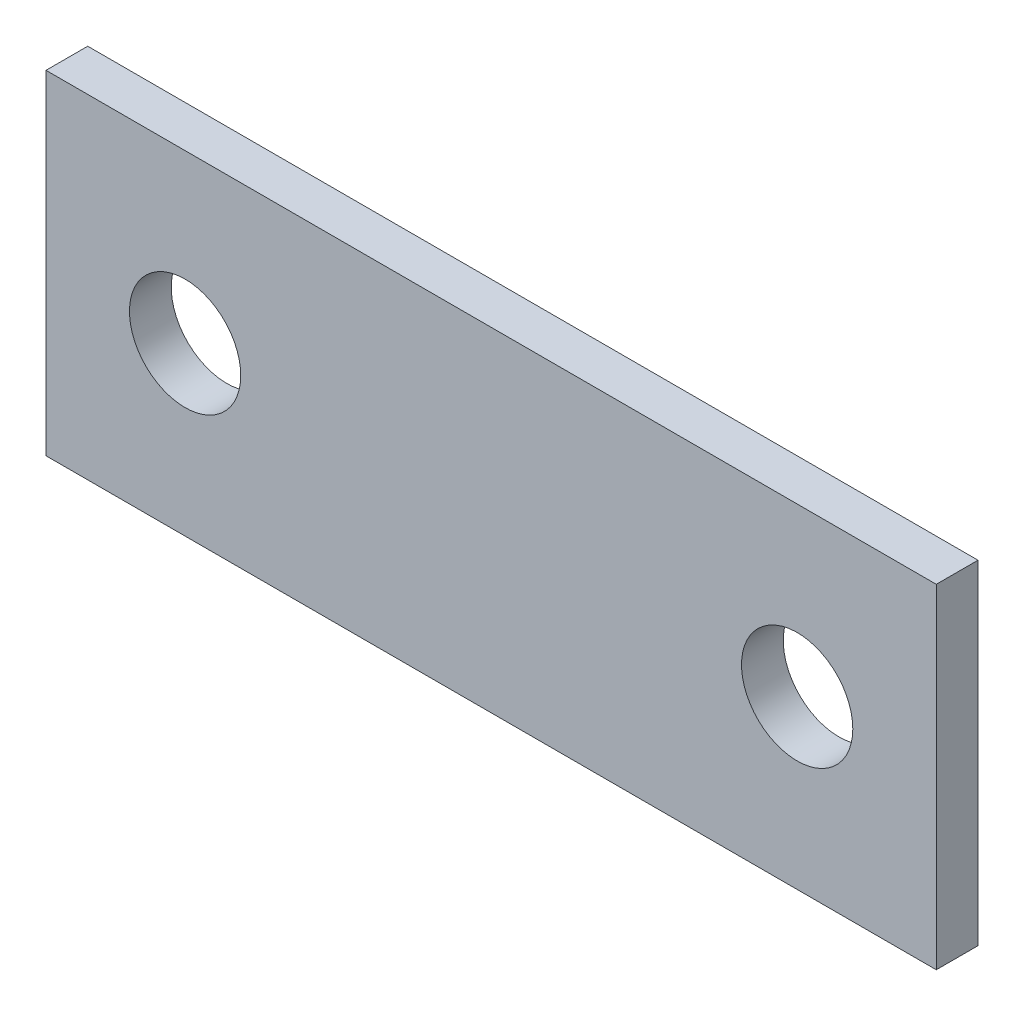
ISO-10303-21;
HEADER;
FILE_DESCRIPTION(('STEP AP214'),'2;1');
FILE_NAME('part.step','',(''),(''),'','','');
FILE_SCHEMA(('AUTOMOTIVE_DESIGN { 1 0 10303 214 1 1 1 1 }'));
ENDSEC;
DATA;
#1=APPLICATION_CONTEXT('core data for automotive mechanical design processes');
#2=APPLICATION_PROTOCOL_DEFINITION('international standard','automotive_design',2000,#1);
#3=PRODUCT_CONTEXT('',#1,'mechanical');
#4=PRODUCT('Part','Part','',(#3));
#5=PRODUCT_RELATED_PRODUCT_CATEGORY('part','',(#4));
#6=PRODUCT_DEFINITION_FORMATION('','',#4);
#7=PRODUCT_DEFINITION_CONTEXT('part definition',#1,'design');
#8=PRODUCT_DEFINITION('design','',#6,#7);
#9=PRODUCT_DEFINITION_SHAPE('','',#8);
#10=(LENGTH_UNIT() NAMED_UNIT(*) SI_UNIT(.MILLI.,.METRE.));
#11=(NAMED_UNIT(*) PLANE_ANGLE_UNIT() SI_UNIT($,.RADIAN.));
#12=(NAMED_UNIT(*) SI_UNIT($,.STERADIAN.) SOLID_ANGLE_UNIT());
#13=UNCERTAINTY_MEASURE_WITH_UNIT(LENGTH_MEASURE(1.E-05),#10,'distance_accuracy_value','');
#14=(GEOMETRIC_REPRESENTATION_CONTEXT(3) GLOBAL_UNCERTAINTY_ASSIGNED_CONTEXT((#13)) GLOBAL_UNIT_ASSIGNED_CONTEXT((#10,
#11,#12)) REPRESENTATION_CONTEXT('',''));
#15=CARTESIAN_POINT('',(0.,0.,0.));
#16=DIRECTION('',(0.,0.,1.));
#17=DIRECTION('',(1.,0.,0.));
#18=AXIS2_PLACEMENT_3D('',#15,#16,#17);
#19=CARTESIAN_POINT('',(-25.4,9.525,2.38125));
#20=DIRECTION('',(0.,0.,1.));
#21=DIRECTION('',(1.,0.,0.));
#22=AXIS2_PLACEMENT_3D('',#19,#20,#21);
#23=PLANE('',#22);
#24=CARTESIAN_POINT('',(-17.4625,0.,2.38125));
#25=DIRECTION('',(0.,0.,1.));
#26=DIRECTION('',(1.,0.,0.));
#27=AXIS2_PLACEMENT_3D('',#24,#25,#26);
#28=CIRCLE('',#27,3.175);
#29=CARTESIAN_POINT('',(-14.2875,0.,2.38125));
#30=VERTEX_POINT('',#29);
#31=EDGE_CURVE('E101',#30,#30,#28,.T.);
#32=ORIENTED_EDGE('',*,*,#31,.F.);
#33=EDGE_LOOP('',(#32));
#34=FACE_BOUND('',#33,.T.);
#35=DIRECTION('',(0.,-1.,0.));
#36=VECTOR('',#35,1.);
#37=CARTESIAN_POINT('',(-25.4,-9.52500000000001,2.38125));
#38=LINE('',#37,#36);
#39=CARTESIAN_POINT('',(-25.4,9.525,2.38125));
#40=VERTEX_POINT('',#39);
#41=CARTESIAN_POINT('',(-25.4,-9.52500000000001,2.38125));
#42=VERTEX_POINT('',#41);
#43=EDGE_CURVE('E86',#40,#42,#38,.T.);
#44=ORIENTED_EDGE('',*,*,#43,.T.);
#45=DIRECTION('',(1.,0.,0.));
#46=VECTOR('',#45,1.);
#47=CARTESIAN_POINT('',(25.4,-9.525,2.38125));
#48=LINE('',#47,#46);
#49=CARTESIAN_POINT('',(25.4,-9.525,2.38125));
#50=VERTEX_POINT('',#49);
#51=EDGE_CURVE('E81',#42,#50,#48,.T.);
#52=ORIENTED_EDGE('',*,*,#51,.T.);
#53=DIRECTION('',(0.,1.,0.));
#54=VECTOR('',#53,1.);
#55=CARTESIAN_POINT('',(25.4,-9.525,2.38125));
#56=LINE('',#55,#54);
#57=CARTESIAN_POINT('',(25.4,9.525,2.38125));
#58=VERTEX_POINT('',#57);
#59=EDGE_CURVE('E84',#50,#58,#56,.T.);
#60=ORIENTED_EDGE('',*,*,#59,.T.);
#61=DIRECTION('',(-1.,0.,0.));
#62=VECTOR('',#61,1.);
#63=CARTESIAN_POINT('',(25.4,9.525,2.38125));
#64=LINE('',#63,#62);
#65=EDGE_CURVE('E51',#58,#40,#64,.T.);
#66=ORIENTED_EDGE('',*,*,#65,.T.);
#67=EDGE_LOOP('',(#44,#52,#60,#66));
#68=FACE_BOUND('',#67,.T.);
#69=CARTESIAN_POINT('',(17.4625,0.,2.38125));
#70=DIRECTION('',(0.,0.,1.));
#71=DIRECTION('',(1.,0.,0.));
#72=AXIS2_PLACEMENT_3D('',#69,#70,#71);
#73=CIRCLE('',#72,3.175);
#74=CARTESIAN_POINT('',(20.6375,0.,2.38125));
#75=VERTEX_POINT('',#74);
#76=EDGE_CURVE('E116',#75,#75,#73,.T.);
#77=ORIENTED_EDGE('',*,*,#76,.F.);
#78=EDGE_LOOP('',(#77));
#79=FACE_BOUND('',#78,.T.);
#80=ADVANCED_FACE('F34',(#34,#68,#79),#23,.T.);
#81=CARTESIAN_POINT('',(-25.4,9.525,0.));
#82=DIRECTION('',(0.,0.,1.));
#83=DIRECTION('',(1.,0.,0.));
#84=AXIS2_PLACEMENT_3D('',#81,#82,#83);
#85=PLANE('',#84);
#86=CARTESIAN_POINT('',(-17.4625,0.,0.));
#87=DIRECTION('',(0.,0.,1.));
#88=DIRECTION('',(1.,0.,0.));
#89=AXIS2_PLACEMENT_3D('',#86,#87,#88);
#90=CIRCLE('',#89,3.175);
#91=CARTESIAN_POINT('',(-14.2875,0.,0.));
#92=VERTEX_POINT('',#91);
#93=EDGE_CURVE('E113',#92,#92,#90,.T.);
#94=ORIENTED_EDGE('',*,*,#93,.T.);
#95=EDGE_LOOP('',(#94));
#96=FACE_BOUND('',#95,.T.);
#97=DIRECTION('',(0.,-1.,0.));
#98=VECTOR('',#97,1.);
#99=CARTESIAN_POINT('',(-25.4,-9.52500000000001,0.));
#100=LINE('',#99,#98);
#101=CARTESIAN_POINT('',(-25.4,9.525,0.));
#102=VERTEX_POINT('',#101);
#103=CARTESIAN_POINT('',(-25.4,-9.52500000000001,0.));
#104=VERTEX_POINT('',#103);
#105=EDGE_CURVE('E98',#102,#104,#100,.T.);
#106=ORIENTED_EDGE('',*,*,#105,.F.);
#107=DIRECTION('',(-1.,0.,0.));
#108=VECTOR('',#107,1.);
#109=CARTESIAN_POINT('',(25.4,9.525,0.));
#110=LINE('',#109,#108);
#111=CARTESIAN_POINT('',(25.4,9.525,0.));
#112=VERTEX_POINT('',#111);
#113=EDGE_CURVE('E74',#112,#102,#110,.T.);
#114=ORIENTED_EDGE('',*,*,#113,.F.);
#115=DIRECTION('',(0.,1.,0.));
#116=VECTOR('',#115,1.);
#117=CARTESIAN_POINT('',(25.4,-9.525,0.));
#118=LINE('',#117,#116);
#119=CARTESIAN_POINT('',(25.4,-9.525,0.));
#120=VERTEX_POINT('',#119);
#121=EDGE_CURVE('E68',#120,#112,#118,.T.);
#122=ORIENTED_EDGE('',*,*,#121,.F.);
#123=DIRECTION('',(1.,0.,0.));
#124=VECTOR('',#123,1.);
#125=CARTESIAN_POINT('',(25.4,-9.525,0.));
#126=LINE('',#125,#124);
#127=EDGE_CURVE('E90',#104,#120,#126,.T.);
#128=ORIENTED_EDGE('',*,*,#127,.F.);
#129=EDGE_LOOP('',(#106,#114,#122,#128));
#130=FACE_BOUND('',#129,.T.);
#131=CARTESIAN_POINT('',(17.4625,0.,0.));
#132=DIRECTION('',(0.,0.,1.));
#133=DIRECTION('',(1.,0.,0.));
#134=AXIS2_PLACEMENT_3D('',#131,#132,#133);
#135=CIRCLE('',#134,3.175);
#136=CARTESIAN_POINT('',(20.6375,0.,0.));
#137=VERTEX_POINT('',#136);
#138=EDGE_CURVE('E119',#137,#137,#135,.T.);
#139=ORIENTED_EDGE('',*,*,#138,.T.);
#140=EDGE_LOOP('',(#139));
#141=FACE_BOUND('',#140,.T.);
#142=ADVANCED_FACE('F109',(#96,#130,#141),#85,.F.);
#143=CARTESIAN_POINT('',(-25.4,-9.52500000000001,2.38125));
#144=DIRECTION('',(1.,0.,0.));
#145=DIRECTION('',(0.,0.,-1.));
#146=AXIS2_PLACEMENT_3D('',#143,#144,#145);
#147=PLANE('',#146);
#148=ORIENTED_EDGE('',*,*,#105,.T.);
#149=DIRECTION('',(0.,0.,-1.));
#150=VECTOR('',#149,1.);
#151=CARTESIAN_POINT('',(-25.4,-9.52500000000001,2.38125));
#152=LINE('',#151,#150);
#153=EDGE_CURVE('E11',#42,#104,#152,.T.);
#154=ORIENTED_EDGE('',*,*,#153,.F.);
#155=ORIENTED_EDGE('',*,*,#43,.F.);
#156=DIRECTION('',(0.,0.,-1.));
#157=VECTOR('',#156,1.);
#158=CARTESIAN_POINT('',(-25.4,9.525,2.38125));
#159=LINE('',#158,#157);
#160=EDGE_CURVE('E94',#40,#102,#159,.T.);
#161=ORIENTED_EDGE('',*,*,#160,.T.);
#162=EDGE_LOOP('',(#148,#154,#155,#161));
#163=FACE_BOUND('',#162,.T.);
#164=ADVANCED_FACE('F36',(#163),#147,.F.);
#165=CARTESIAN_POINT('',(25.4,-9.525,2.38125));
#166=DIRECTION('',(0.,1.,0.));
#167=DIRECTION('',(-1.,0.,0.));
#168=AXIS2_PLACEMENT_3D('',#165,#166,#167);
#169=PLANE('',#168);
#170=ORIENTED_EDGE('',*,*,#127,.T.);
#171=DIRECTION('',(0.,0.,-1.));
#172=VECTOR('',#171,1.);
#173=CARTESIAN_POINT('',(25.4,-9.525,2.38125));
#174=LINE('',#173,#172);
#175=EDGE_CURVE('E43',#50,#120,#174,.T.);
#176=ORIENTED_EDGE('',*,*,#175,.F.);
#177=ORIENTED_EDGE('',*,*,#51,.F.);
#178=ORIENTED_EDGE('',*,*,#153,.T.);
#179=EDGE_LOOP('',(#170,#176,#177,#178));
#180=FACE_BOUND('',#179,.T.);
#181=ADVANCED_FACE('F89',(#180),#169,.F.);
#182=CARTESIAN_POINT('',(25.4,-9.525,2.38125));
#183=DIRECTION('',(-1.,0.,0.));
#184=DIRECTION('',(0.,0.,1.));
#185=AXIS2_PLACEMENT_3D('',#182,#183,#184);
#186=PLANE('',#185);
#187=ORIENTED_EDGE('',*,*,#121,.T.);
#188=DIRECTION('',(0.,0.,-1.));
#189=VECTOR('',#188,1.);
#190=CARTESIAN_POINT('',(25.4,9.525,2.38125));
#191=LINE('',#190,#189);
#192=EDGE_CURVE('E91',#58,#112,#191,.T.);
#193=ORIENTED_EDGE('',*,*,#192,.F.);
#194=ORIENTED_EDGE('',*,*,#59,.F.);
#195=ORIENTED_EDGE('',*,*,#175,.T.);
#196=EDGE_LOOP('',(#187,#193,#194,#195));
#197=FACE_BOUND('',#196,.T.);
#198=ADVANCED_FACE('F92',(#197),#186,.F.);
#199=CARTESIAN_POINT('',(25.4,9.525,2.38125));
#200=DIRECTION('',(0.,-1.,0.));
#201=DIRECTION('',(1.,0.,0.));
#202=AXIS2_PLACEMENT_3D('',#199,#200,#201);
#203=PLANE('',#202);
#204=ORIENTED_EDGE('',*,*,#113,.T.);
#205=ORIENTED_EDGE('',*,*,#160,.F.);
#206=ORIENTED_EDGE('',*,*,#65,.F.);
#207=ORIENTED_EDGE('',*,*,#192,.T.);
#208=EDGE_LOOP('',(#204,#205,#206,#207));
#209=FACE_BOUND('',#208,.T.);
#210=ADVANCED_FACE('F106',(#209),#203,.F.);
#211=CARTESIAN_POINT('',(-17.4625,0.,2.38125));
#212=DIRECTION('',(0.,0.,-1.));
#213=DIRECTION('',(-1.,0.,0.));
#214=AXIS2_PLACEMENT_3D('',#211,#212,#213);
#215=CYLINDRICAL_SURFACE('',#214,3.175);
#216=ORIENTED_EDGE('',*,*,#31,.T.);
#217=EDGE_LOOP('',(#216));
#218=FACE_BOUND('',#217,.T.);
#219=ORIENTED_EDGE('',*,*,#93,.F.);
#220=EDGE_LOOP('',(#219));
#221=FACE_BOUND('',#220,.T.);
#222=ADVANCED_FACE('F137',(#218,#221),#215,.F.);
#223=CARTESIAN_POINT('',(17.4625,0.,2.38125));
#224=DIRECTION('',(0.,0.,-1.));
#225=DIRECTION('',(-1.,0.,0.));
#226=AXIS2_PLACEMENT_3D('',#223,#224,#225);
#227=CYLINDRICAL_SURFACE('',#226,3.175);
#228=ORIENTED_EDGE('',*,*,#76,.T.);
#229=EDGE_LOOP('',(#228));
#230=FACE_BOUND('',#229,.T.);
#231=ORIENTED_EDGE('',*,*,#138,.F.);
#232=EDGE_LOOP('',(#231));
#233=FACE_BOUND('',#232,.T.);
#234=ADVANCED_FACE('F125',(#230,#233),#227,.F.);
#235=CLOSED_SHELL('',(#80,#142,#164,#181,#198,#210,#222,#234));
#236=MANIFOLD_SOLID_BREP('B2',#235);
#237=ADVANCED_BREP_SHAPE_REPRESENTATION('',(#18,#236),#14);
#238=SHAPE_DEFINITION_REPRESENTATION(#9,#237);
ENDSEC;
END-ISO-10303-21;
